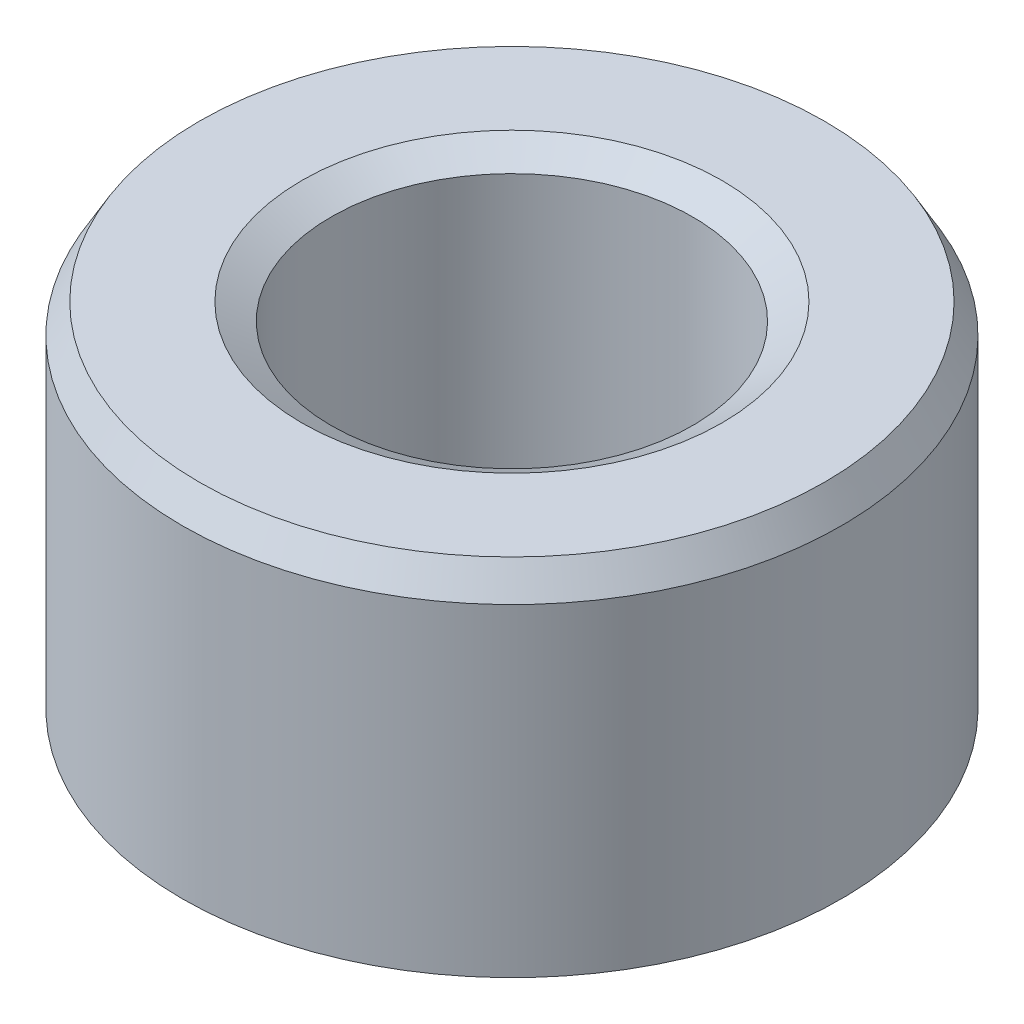
ISO-10303-21;
HEADER;
FILE_DESCRIPTION(('STEP AP214'),'2;1');
FILE_NAME('part.step','',(''),(''),'','','');
FILE_SCHEMA(('AUTOMOTIVE_DESIGN { 1 0 10303 214 1 1 1 1 }'));
ENDSEC;
DATA;
#1=APPLICATION_CONTEXT('core data for automotive mechanical design processes');
#2=APPLICATION_PROTOCOL_DEFINITION('international standard','automotive_design',2000,#1);
#3=PRODUCT_CONTEXT('',#1,'mechanical');
#4=PRODUCT('Part','Part','',(#3));
#5=PRODUCT_RELATED_PRODUCT_CATEGORY('part','',(#4));
#6=PRODUCT_DEFINITION_FORMATION('','',#4);
#7=PRODUCT_DEFINITION_CONTEXT('part definition',#1,'design');
#8=PRODUCT_DEFINITION('design','',#6,#7);
#9=PRODUCT_DEFINITION_SHAPE('','',#8);
#10=(LENGTH_UNIT() NAMED_UNIT(*) SI_UNIT(.MILLI.,.METRE.));
#11=(NAMED_UNIT(*) PLANE_ANGLE_UNIT() SI_UNIT($,.RADIAN.));
#12=(NAMED_UNIT(*) SI_UNIT($,.STERADIAN.) SOLID_ANGLE_UNIT());
#13=UNCERTAINTY_MEASURE_WITH_UNIT(LENGTH_MEASURE(1.E-05),#10,'distance_accuracy_value','');
#14=(GEOMETRIC_REPRESENTATION_CONTEXT(3) GLOBAL_UNCERTAINTY_ASSIGNED_CONTEXT((#13)) GLOBAL_UNIT_ASSIGNED_CONTEXT((#10,
#11,#12)) REPRESENTATION_CONTEXT('',''));
#15=CARTESIAN_POINT('',(0.,0.,0.));
#16=DIRECTION('',(0.,0.,1.));
#17=DIRECTION('',(1.,0.,0.));
#18=AXIS2_PLACEMENT_3D('',#15,#16,#17);
#19=CARTESIAN_POINT('',(0.,42.0187532845206,0.));
#20=DIRECTION('',(0.,-1.,0.));
#21=DIRECTION('',(0.,0.,-1.));
#22=AXIS2_PLACEMENT_3D('',#19,#20,#21);
#23=CYLINDRICAL_SURFACE('',#22,37.5);
#24=CARTESIAN_POINT('',(0.,1.92346553201773,0.));
#25=DIRECTION('',(0.,1.,0.));
#26=DIRECTION('',(0.,0.,1.));
#27=AXIS2_PLACEMENT_3D('',#24,#25,#26);
#28=CIRCLE('',#27,37.5);
#29=CARTESIAN_POINT('',(0.,1.92346553201773,37.5));
#30=VERTEX_POINT('',#29);
#31=EDGE_CURVE('E10',#30,#30,#28,.T.);
#32=ORIENTED_EDGE('',*,*,#31,.T.);
#33=EDGE_LOOP('',(#32));
#34=FACE_BOUND('',#33,.T.);
#35=CARTESIAN_POINT('',(0.,38.6872132564583,0.));
#36=DIRECTION('',(0.,1.,0.));
#37=DIRECTION('',(0.,0.,1.));
#38=AXIS2_PLACEMENT_3D('',#35,#36,#37);
#39=CIRCLE('',#38,37.5);
#40=CARTESIAN_POINT('',(0.,38.6872132564583,37.5));
#41=VERTEX_POINT('',#40);
#42=EDGE_CURVE('E50',#41,#41,#39,.F.);
#43=ORIENTED_EDGE('',*,*,#42,.T.);
#44=EDGE_LOOP('',(#43));
#45=FACE_BOUND('',#44,.T.);
#46=ADVANCED_FACE('F39',(#34,#45),#23,.T.);
#47=CARTESIAN_POINT('',(0.,42.0187532845206,0.));
#48=DIRECTION('',(0.,1.,0.));
#49=DIRECTION('',(0.,0.,1.));
#50=AXIS2_PLACEMENT_3D('',#47,#48,#49);
#51=PLANE('',#50);
#52=CARTESIAN_POINT('',(0.,42.0187532845206,0.));
#53=DIRECTION('',(0.,1.,0.));
#54=DIRECTION('',(0.,0.,1.));
#55=AXIS2_PLACEMENT_3D('',#52,#53,#54);
#56=CIRCLE('',#55,23.9017194289038);
#57=CARTESIAN_POINT('',(0.,42.0187532845206,23.9017194289038));
#58=VERTEX_POINT('',#57);
#59=EDGE_CURVE('E58',#58,#58,#56,.F.);
#60=ORIENTED_EDGE('',*,*,#59,.T.);
#61=EDGE_LOOP('',(#60));
#62=FACE_BOUND('',#61,.T.);
#63=CARTESIAN_POINT('',(0.,42.0187532845206,0.));
#64=DIRECTION('',(0.,1.,0.));
#65=DIRECTION('',(0.,0.,1.));
#66=AXIS2_PLACEMENT_3D('',#63,#64,#65);
#67=CIRCLE('',#66,35.5765344679822);
#68=CARTESIAN_POINT('',(0.,42.0187532845206,35.5765344679822));
#69=VERTEX_POINT('',#68);
#70=EDGE_CURVE('E61',#69,#69,#67,.T.);
#71=ORIENTED_EDGE('',*,*,#70,.T.);
#72=EDGE_LOOP('',(#71));
#73=FACE_BOUND('',#72,.T.);
#74=ADVANCED_FACE('F88',(#62,#73),#51,.T.);
#75=CARTESIAN_POINT('',(0.,0.,0.));
#76=DIRECTION('',(0.,1.,0.));
#77=DIRECTION('',(0.,0.,1.));
#78=AXIS2_PLACEMENT_3D('',#75,#76,#77);
#79=PLANE('',#78);
#80=CARTESIAN_POINT('',(0.,0.,0.));
#81=DIRECTION('',(0.,1.,0.));
#82=DIRECTION('',(0.,0.,1.));
#83=AXIS2_PLACEMENT_3D('',#80,#81,#82);
#84=CIRCLE('',#83,22.4936449328593);
#85=CARTESIAN_POINT('',(0.,0.,22.4936449328593));
#86=VERTEX_POINT('',#85);
#87=EDGE_CURVE('E51',#86,#86,#84,.T.);
#88=ORIENTED_EDGE('',*,*,#87,.T.);
#89=EDGE_LOOP('',(#88));
#90=FACE_BOUND('',#89,.T.);
#91=CARTESIAN_POINT('',(0.,0.,0.));
#92=DIRECTION('',(0.,1.,0.));
#93=DIRECTION('',(0.,0.,1.));
#94=AXIS2_PLACEMENT_3D('',#91,#92,#93);
#95=CIRCLE('',#94,34.1684599719378);
#96=CARTESIAN_POINT('',(0.,0.,34.1684599719378));
#97=VERTEX_POINT('',#96);
#98=EDGE_CURVE('E54',#97,#97,#95,.F.);
#99=ORIENTED_EDGE('',*,*,#98,.T.);
#100=EDGE_LOOP('',(#99));
#101=FACE_BOUND('',#100,.T.);
#102=ADVANCED_FACE('F83',(#90,#101),#79,.F.);
#103=CARTESIAN_POINT('',(0.,42.0187532845206,0.));
#104=DIRECTION('',(0.,-1.,0.));
#105=DIRECTION('',(0.,0.,-1.));
#106=AXIS2_PLACEMENT_3D('',#103,#104,#105);
#107=CYLINDRICAL_SURFACE('',#106,20.5701794008416);
#108=CARTESIAN_POINT('',(0.,40.0952877525028,0.));
#109=DIRECTION('',(0.,1.,0.));
#110=DIRECTION('',(0.,0.,1.));
#111=AXIS2_PLACEMENT_3D('',#108,#109,#110);
#112=CIRCLE('',#111,20.5701794008416);
#113=CARTESIAN_POINT('',(0.,40.0952877525028,20.5701794008416));
#114=VERTEX_POINT('',#113);
#115=EDGE_CURVE('E67',#114,#114,#112,.T.);
#116=ORIENTED_EDGE('',*,*,#115,.T.);
#117=EDGE_LOOP('',(#116));
#118=FACE_BOUND('',#117,.T.);
#119=CARTESIAN_POINT('',(0.,3.33154002806222,0.));
#120=DIRECTION('',(0.,1.,0.));
#121=DIRECTION('',(0.,0.,1.));
#122=AXIS2_PLACEMENT_3D('',#119,#120,#121);
#123=CIRCLE('',#122,20.5701794008416);
#124=CARTESIAN_POINT('',(0.,3.33154002806222,20.5701794008416));
#125=VERTEX_POINT('',#124);
#126=EDGE_CURVE('E69',#125,#125,#123,.F.);
#127=ORIENTED_EDGE('',*,*,#126,.T.);
#128=EDGE_LOOP('',(#127));
#129=FACE_BOUND('',#128,.T.);
#130=ADVANCED_FACE('F71',(#118,#129),#107,.F.);
#131=CARTESIAN_POINT('',(0.,40.0952877525028,0.));
#132=DIRECTION('',(0.,1.,0.));
#133=DIRECTION('',(0.,0.,1.));
#134=AXIS2_PLACEMENT_3D('',#131,#132,#133);
#135=CONICAL_SURFACE('',#134,20.5701794008416,1.0471975511966);
#136=ORIENTED_EDGE('',*,*,#59,.F.);
#137=EDGE_LOOP('',(#136));
#138=FACE_BOUND('',#137,.T.);
#139=ORIENTED_EDGE('',*,*,#115,.F.);
#140=EDGE_LOOP('',(#139));
#141=FACE_BOUND('',#140,.T.);
#142=ADVANCED_FACE('F77',(#138,#141),#135,.F.);
#143=CARTESIAN_POINT('',(0.,0.,0.));
#144=DIRECTION('',(0.,-1.,0.));
#145=DIRECTION('',(0.,0.,-1.));
#146=AXIS2_PLACEMENT_3D('',#143,#144,#145);
#147=CONICAL_SURFACE('',#146,22.4936449328593,0.523598775598296);
#148=ORIENTED_EDGE('',*,*,#126,.F.);
#149=EDGE_LOOP('',(#148));
#150=FACE_BOUND('',#149,.T.);
#151=ORIENTED_EDGE('',*,*,#87,.F.);
#152=EDGE_LOOP('',(#151));
#153=FACE_BOUND('',#152,.T.);
#154=ADVANCED_FACE('F73',(#150,#153),#147,.F.);
#155=CARTESIAN_POINT('',(0.,1.92346553201773,0.));
#156=DIRECTION('',(0.,1.,0.));
#157=DIRECTION('',(0.,0.,1.));
#158=AXIS2_PLACEMENT_3D('',#155,#156,#157);
#159=CONICAL_SURFACE('',#158,37.5,1.0471975511966);
#160=CARTESIAN_POINT('',(0.,0.,34.1684599719378));
#161=CARTESIAN_POINT('',(0.,0.0200360992918512,34.2031635138967));
#162=CARTESIAN_POINT('',(0.,0.0400721985837026,34.2378670558557));
#163=CARTESIAN_POINT('',(0.,0.0801443971674054,34.3072741397737));
#164=CARTESIAN_POINT('',(0.,0.100180496459257,34.3419776817327));
#165=CARTESIAN_POINT('',(0.,0.14025269504296,34.4113847656506));
#166=CARTESIAN_POINT('',(0.,0.160288794334811,34.4460883076096));
#167=CARTESIAN_POINT('',(0.,0.200360992918514,34.5154953915276));
#168=CARTESIAN_POINT('',(0.,0.220397092210365,34.5501989334865));
#169=CARTESIAN_POINT('',(0.,0.260469290794068,34.6196060174045));
#170=CARTESIAN_POINT('',(0.,0.280505390085919,34.6543095593635));
#171=CARTESIAN_POINT('',(0.,0.320577588669622,34.7237166432815));
#172=CARTESIAN_POINT('',(0.,0.340613687961474,34.7584201852404));
#173=CARTESIAN_POINT('',(0.,0.380685886545176,34.8278272691584));
#174=CARTESIAN_POINT('',(0.,0.400721985837028,34.8625308111174));
#175=CARTESIAN_POINT('',(0.,0.440794184420731,34.9319378950353));
#176=CARTESIAN_POINT('',(0.,0.460830283712582,34.9666414369943));
#177=CARTESIAN_POINT('',(0.,0.500902482296285,35.0360485209123));
#178=CARTESIAN_POINT('',(0.,0.520938581588136,35.0707520628713));
#179=CARTESIAN_POINT('',(0.,0.561010780171839,35.1401591467892));
#180=CARTESIAN_POINT('',(0.,0.581046879463691,35.1748626887482));
#181=CARTESIAN_POINT('',(0.,0.621119078047394,35.2442697726662));
#182=CARTESIAN_POINT('',(0.,0.641155177339244,35.2789733146252));
#183=CARTESIAN_POINT('',(0.,0.681227375922947,35.3483803985431));
#184=CARTESIAN_POINT('',(0.,0.701263475214799,35.3830839405021));
#185=CARTESIAN_POINT('',(0.,0.741335673798502,35.4524910244201));
#186=CARTESIAN_POINT('',(0.,0.761371773090353,35.4871945663791));
#187=CARTESIAN_POINT('',(0.,0.801443971674056,35.556601650297));
#188=CARTESIAN_POINT('',(0.,0.821480070965907,35.591305192256));
#189=CARTESIAN_POINT('',(0.,0.86155226954961,35.660712276174));
#190=CARTESIAN_POINT('',(0.,0.881588368841462,35.695415818133));
#191=CARTESIAN_POINT('',(0.,0.921660567425164,35.7648229020509));
#192=CARTESIAN_POINT('',(0.,0.941696666717016,35.7995264440099));
#193=CARTESIAN_POINT('',(0.,0.981768865300718,35.8689335279279));
#194=CARTESIAN_POINT('',(0.,1.00180496459257,35.9036370698868));
#195=CARTESIAN_POINT('',(0.,1.04187716317627,35.9730441538048));
#196=CARTESIAN_POINT('',(0.,1.06191326246812,36.0077476957638));
#197=CARTESIAN_POINT('',(0.,1.10198546105183,36.0771547796817));
#198=CARTESIAN_POINT('',(0.,1.12202156034368,36.1118583216407));
#199=CARTESIAN_POINT('',(0.,1.16209375892738,36.1812654055587));
#200=CARTESIAN_POINT('',(0.,1.18212985821923,36.2159689475177));
#201=CARTESIAN_POINT('',(0.,1.22220205680294,36.2853760314356));
#202=CARTESIAN_POINT('',(0.,1.24223815609479,36.3200795733946));
#203=CARTESIAN_POINT('',(0.,1.28231035467849,36.3894866573126));
#204=CARTESIAN_POINT('',(0.,1.30234645397034,36.4241901992716));
#205=CARTESIAN_POINT('',(0.,1.34241865255404,36.4935972831895));
#206=CARTESIAN_POINT('',(0.,1.3624547518459,36.5283008251485));
#207=CARTESIAN_POINT('',(0.,1.4025269504296,36.5977079090665));
#208=CARTESIAN_POINT('',(0.,1.42256304972145,36.6324114510255));
#209=CARTESIAN_POINT('',(0.,1.46263524830515,36.7018185349434));
#210=CARTESIAN_POINT('',(0.,1.482671347597,36.7365220769024));
#211=CARTESIAN_POINT('',(0.,1.52274354618071,36.8059291608204));
#212=CARTESIAN_POINT('',(0.,1.54277964547256,36.8406327027794));
#213=CARTESIAN_POINT('',(0.,1.58285184405626,36.9100397866973));
#214=CARTESIAN_POINT('',(0.,1.60288794334811,36.9447433286563));
#215=CARTESIAN_POINT('',(0.,1.64296014193181,37.0141504125743));
#216=CARTESIAN_POINT('',(0.,1.66299624122367,37.0488539545332));
#217=CARTESIAN_POINT('',(0.,1.70306843980737,37.1182610384512));
#218=CARTESIAN_POINT('',(0.,1.72310453909922,37.1529645804102));
#219=CARTESIAN_POINT('',(0.,1.76317673768292,37.2223716643282));
#220=CARTESIAN_POINT('',(0.,1.78321283697477,37.2570752062871));
#221=CARTESIAN_POINT('',(0.,1.82328503555848,37.3264822902051));
#222=CARTESIAN_POINT('',(0.,1.84332113485033,37.3611858321641));
#223=CARTESIAN_POINT('',(0.,1.88339333343403,37.430592916082));
#224=CARTESIAN_POINT('',(0.,1.90342943272588,37.465296458041));
#225=CARTESIAN_POINT('',(0.,1.92346553201773,37.5));
#226=B_SPLINE_CURVE_WITH_KNOTS('',3,(#160,#161,#162,#163,#164,#165,#166,#167,#168,#169,#170,
#171,#172,#173,#174,#175,#176,#177,#178,#179,#180,#181,#182,#183,#184,#185,#186,#187,#188,#189,
#190,#191,#192,#193,#194,#195,#196,#197,#198,#199,#200,#201,#202,#203,#204,#205,#206,#207,#208,
#209,#210,#211,#212,#213,#214,#215,#216,#217,#218,#219,#220,#221,#222,#223,#224,#225),
.UNSPECIFIED.,.F.,.F.,(4,2,2,2,2,2,2,2,2,2,2,2,2,2,2,2,2,2,2,2,2,2,2,2,2,2,2,2,2,2,2,2,4),(0.,
0.120216595751109,0.240433191502218,0.360649787253327,0.480866383004436,0.601082978755545,
0.721299574506654,0.841516170257763,0.961732766008872,1.08194936175998,1.20216595751109,
1.32238255326221,1.44259914901331,1.56281574476442,1.68303234051553,1.80324893626664,
1.92346553201775,2.04368212776886,2.16389872351997,2.28411531927108,2.40433191502219,
2.5245485107733,2.6447651065244,2.76498170227551,2.88519829802662,3.00541489377773,
3.12563148952885,3.24584808527995,3.36606468103106,3.48628127678217,3.60649787253328,
3.72671446828439,3.8469310640355),.UNSPECIFIED.);
#227=EDGE_CURVE('BSEAM76',#97,#30,#226,.T.);
#228=ORIENTED_EDGE('',*,*,#98,.F.);
#229=ORIENTED_EDGE('',*,*,#31,.F.);
#230=ORIENTED_EDGE('',*,*,#227,.T.);
#231=ORIENTED_EDGE('',*,*,#227,.F.);
#232=EDGE_LOOP('',(#228,#230,#229,#231));
#233=FACE_BOUND('',#232,.T.);
#234=ADVANCED_FACE('F76',(#233),#159,.T.);
#235=CARTESIAN_POINT('',(0.,42.0187532845206,0.));
#236=DIRECTION('',(0.,-1.,0.));
#237=DIRECTION('',(0.,0.,-1.));
#238=AXIS2_PLACEMENT_3D('',#235,#236,#237);
#239=CONICAL_SURFACE('',#238,35.5765344679822,0.523598775598294);
#240=ORIENTED_EDGE('',*,*,#42,.F.);
#241=EDGE_LOOP('',(#240));
#242=FACE_BOUND('',#241,.T.);
#243=ORIENTED_EDGE('',*,*,#70,.F.);
#244=EDGE_LOOP('',(#243));
#245=FACE_BOUND('',#244,.T.);
#246=ADVANCED_FACE('F45',(#242,#245),#239,.T.);
#247=CLOSED_SHELL('',(#46,#74,#102,#130,#142,#154,#234,#246));
#248=MANIFOLD_SOLID_BREP('B2',#247);
#249=ADVANCED_BREP_SHAPE_REPRESENTATION('',(#18,#248),#14);
#250=SHAPE_DEFINITION_REPRESENTATION(#9,#249);
ENDSEC;
END-ISO-10303-21;
